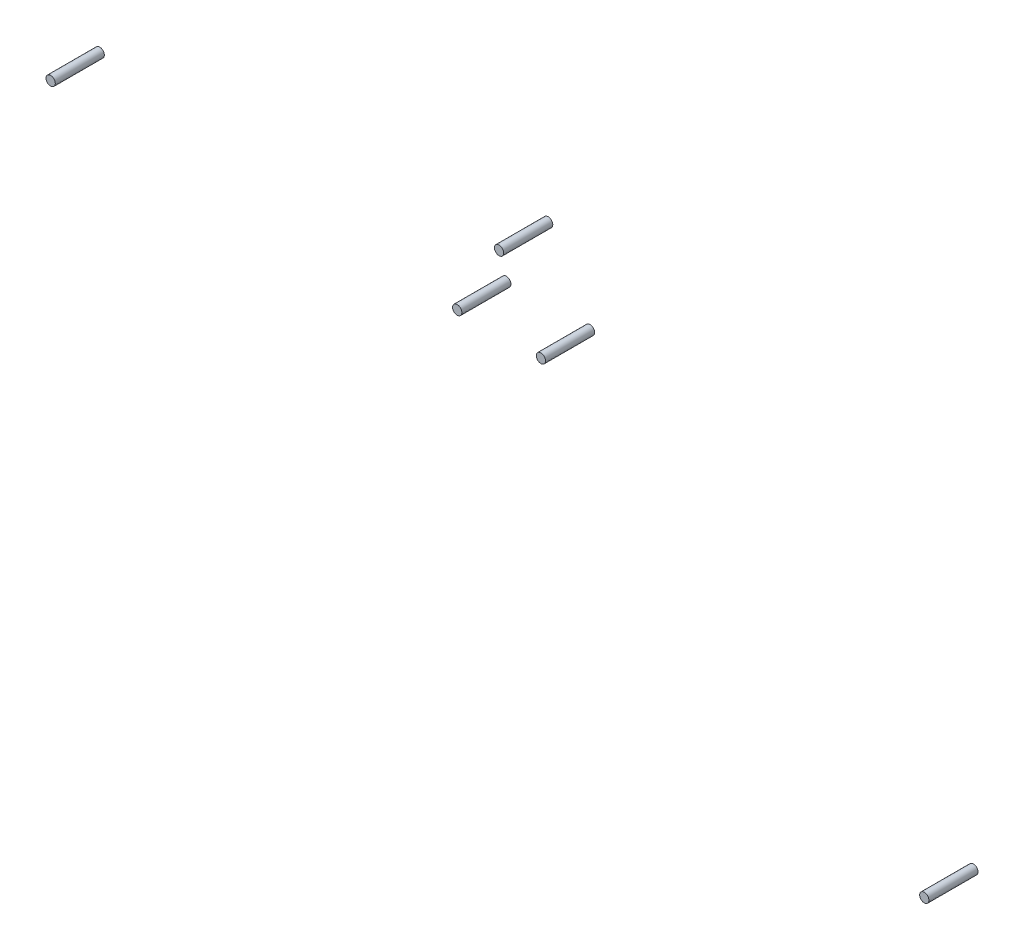
ISO-10303-21;
HEADER;
FILE_DESCRIPTION(('STEP AP214'),'2;1');
FILE_NAME('part.step','',(''),(''),'','','');
FILE_SCHEMA(('AUTOMOTIVE_DESIGN { 1 0 10303 214 1 1 1 1 }'));
ENDSEC;
DATA;
#1=APPLICATION_CONTEXT('core data for automotive mechanical design processes');
#2=APPLICATION_PROTOCOL_DEFINITION('international standard','automotive_design',2000,#1);
#3=PRODUCT_CONTEXT('',#1,'mechanical');
#4=PRODUCT('Part','Part','',(#3));
#5=PRODUCT_RELATED_PRODUCT_CATEGORY('part','',(#4));
#6=PRODUCT_DEFINITION_FORMATION('','',#4);
#7=PRODUCT_DEFINITION_CONTEXT('part definition',#1,'design');
#8=PRODUCT_DEFINITION('design','',#6,#7);
#9=PRODUCT_DEFINITION_SHAPE('','',#8);
#10=(LENGTH_UNIT() NAMED_UNIT(*) SI_UNIT(.MILLI.,.METRE.));
#11=(NAMED_UNIT(*) PLANE_ANGLE_UNIT() SI_UNIT($,.RADIAN.));
#12=(NAMED_UNIT(*) SI_UNIT($,.STERADIAN.) SOLID_ANGLE_UNIT());
#13=UNCERTAINTY_MEASURE_WITH_UNIT(LENGTH_MEASURE(1.E-05),#10,'distance_accuracy_value','');
#14=(GEOMETRIC_REPRESENTATION_CONTEXT(3) GLOBAL_UNCERTAINTY_ASSIGNED_CONTEXT((#13)) GLOBAL_UNIT_ASSIGNED_CONTEXT((#10,
#11,#12)) REPRESENTATION_CONTEXT('',''));
#15=CARTESIAN_POINT('',(0.,0.,0.));
#16=DIRECTION('',(0.,0.,1.));
#17=DIRECTION('',(1.,0.,0.));
#18=AXIS2_PLACEMENT_3D('',#15,#16,#17);
#19=CARTESIAN_POINT('',(-66.4999999999998,49.7499999999999,6.35));
#20=DIRECTION('',(0.,0.,-1.));
#21=DIRECTION('',(-1.,0.,0.));
#22=AXIS2_PLACEMENT_3D('',#19,#20,#21);
#23=CYLINDRICAL_SURFACE('',#22,0.600000000000008);
#24=CARTESIAN_POINT('',(-66.4999999999998,49.7499999999999,6.35));
#25=DIRECTION('',(0.,0.,1.));
#26=DIRECTION('',(1.,0.,0.));
#27=AXIS2_PLACEMENT_3D('',#24,#25,#26);
#28=CIRCLE('',#27,0.600000000000008);
#29=CARTESIAN_POINT('',(-65.8999999999998,49.7499999999999,6.35));
#30=VERTEX_POINT('',#29);
#31=EDGE_CURVE('E11',#30,#30,#28,.T.);
#32=ORIENTED_EDGE('',*,*,#31,.F.);
#33=EDGE_LOOP('',(#32));
#34=FACE_BOUND('',#33,.T.);
#35=CARTESIAN_POINT('',(-66.4999999999998,49.7499999999999,0.));
#36=DIRECTION('',(0.,0.,1.));
#37=DIRECTION('',(1.,0.,0.));
#38=AXIS2_PLACEMENT_3D('',#35,#36,#37);
#39=CIRCLE('',#38,0.600000000000008);
#40=CARTESIAN_POINT('',(-65.8999999999998,49.7499999999999,0.));
#41=VERTEX_POINT('',#40);
#42=EDGE_CURVE('E43',#41,#41,#39,.T.);
#43=ORIENTED_EDGE('',*,*,#42,.T.);
#44=EDGE_LOOP('',(#43));
#45=FACE_BOUND('',#44,.T.);
#46=ADVANCED_FACE('F40',(#34,#45),#23,.T.);
#47=CARTESIAN_POINT('',(-66.4999999999998,49.7499999999999,6.35));
#48=DIRECTION('',(0.,0.,1.));
#49=DIRECTION('',(1.,0.,0.));
#50=AXIS2_PLACEMENT_3D('',#47,#48,#49);
#51=PLANE('',#50);
#52=ORIENTED_EDGE('',*,*,#31,.T.);
#53=EDGE_LOOP('',(#52));
#54=FACE_BOUND('',#53,.T.);
#55=ADVANCED_FACE('F55',(#54),#51,.T.);
#56=CARTESIAN_POINT('',(-66.4999999999998,49.7499999999999,0.));
#57=DIRECTION('',(0.,0.,1.));
#58=DIRECTION('',(1.,0.,0.));
#59=AXIS2_PLACEMENT_3D('',#56,#57,#58);
#60=PLANE('',#59);
#61=ORIENTED_EDGE('',*,*,#42,.F.);
#62=EDGE_LOOP('',(#61));
#63=FACE_BOUND('',#62,.T.);
#64=ADVANCED_FACE('F53',(#63),#60,.F.);
#65=CLOSED_SHELL('',(#46,#55,#64));
#66=MANIFOLD_SOLID_BREP('B2',#65);
#67=CARTESIAN_POINT('',(46.5000000000002,14.7499999999999,6.35));
#68=DIRECTION('',(0.,0.,-1.));
#69=DIRECTION('',(-1.,0.,0.));
#70=AXIS2_PLACEMENT_3D('',#67,#68,#69);
#71=CYLINDRICAL_SURFACE('',#70,0.599999999999992);
#72=CARTESIAN_POINT('',(46.5000000000002,14.7499999999999,6.35));
#73=DIRECTION('',(0.,0.,1.));
#74=DIRECTION('',(1.,0.,0.));
#75=AXIS2_PLACEMENT_3D('',#72,#73,#74);
#76=CIRCLE('',#75,0.599999999999992);
#77=CARTESIAN_POINT('',(47.1000000000002,14.7499999999999,6.35));
#78=VERTEX_POINT('',#77);
#79=EDGE_CURVE('E39',#78,#78,#76,.T.);
#80=ORIENTED_EDGE('',*,*,#79,.F.);
#81=EDGE_LOOP('',(#80));
#82=FACE_BOUND('',#81,.T.);
#83=CARTESIAN_POINT('',(46.5000000000002,14.7499999999999,0.));
#84=DIRECTION('',(0.,0.,1.));
#85=DIRECTION('',(1.,0.,0.));
#86=AXIS2_PLACEMENT_3D('',#83,#84,#85);
#87=CIRCLE('',#86,0.599999999999992);
#88=CARTESIAN_POINT('',(47.1000000000002,14.7499999999999,0.));
#89=VERTEX_POINT('',#88);
#90=EDGE_CURVE('E92',#89,#89,#87,.T.);
#91=ORIENTED_EDGE('',*,*,#90,.T.);
#92=EDGE_LOOP('',(#91));
#93=FACE_BOUND('',#92,.T.);
#94=ADVANCED_FACE('F89',(#82,#93),#71,.T.);
#95=CARTESIAN_POINT('',(46.5000000000002,14.7499999999999,6.35));
#96=DIRECTION('',(0.,0.,1.));
#97=DIRECTION('',(1.,0.,0.));
#98=AXIS2_PLACEMENT_3D('',#95,#96,#97);
#99=PLANE('',#98);
#100=ORIENTED_EDGE('',*,*,#79,.T.);
#101=EDGE_LOOP('',(#100));
#102=FACE_BOUND('',#101,.T.);
#103=ADVANCED_FACE('F104',(#102),#99,.T.);
#104=CARTESIAN_POINT('',(46.5000000000002,14.7499999999999,0.));
#105=DIRECTION('',(0.,0.,1.));
#106=DIRECTION('',(1.,0.,0.));
#107=AXIS2_PLACEMENT_3D('',#104,#105,#106);
#108=PLANE('',#107);
#109=ORIENTED_EDGE('',*,*,#90,.F.);
#110=EDGE_LOOP('',(#109));
#111=FACE_BOUND('',#110,.T.);
#112=ADVANCED_FACE('F102',(#111),#108,.F.);
#113=CLOSED_SHELL('',(#94,#103,#112));
#114=MANIFOLD_SOLID_BREP('B6',#113);
#115=CARTESIAN_POINT('',(-13.9126587736528,50.3749999999999,6.35));
#116=DIRECTION('',(0.,0.,-1.));
#117=DIRECTION('',(-1.,0.,0.));
#118=AXIS2_PLACEMENT_3D('',#115,#116,#117);
#119=CYLINDRICAL_SURFACE('',#118,0.599999999999997);
#120=CARTESIAN_POINT('',(-13.9126587736528,50.3749999999999,6.35));
#121=DIRECTION('',(0.,0.,1.));
#122=DIRECTION('',(1.,0.,0.));
#123=AXIS2_PLACEMENT_3D('',#120,#121,#122);
#124=CIRCLE('',#123,0.599999999999997);
#125=CARTESIAN_POINT('',(-13.3126587736528,50.3749999999999,6.35));
#126=VERTEX_POINT('',#125);
#127=EDGE_CURVE('E88',#126,#126,#124,.T.);
#128=ORIENTED_EDGE('',*,*,#127,.F.);
#129=EDGE_LOOP('',(#128));
#130=FACE_BOUND('',#129,.T.);
#131=CARTESIAN_POINT('',(-13.9126587736528,50.3749999999999,0.));
#132=DIRECTION('',(0.,0.,1.));
#133=DIRECTION('',(1.,0.,0.));
#134=AXIS2_PLACEMENT_3D('',#131,#132,#133);
#135=CIRCLE('',#134,0.599999999999997);
#136=CARTESIAN_POINT('',(-13.3126587736528,50.3749999999999,0.));
#137=VERTEX_POINT('',#136);
#138=EDGE_CURVE('E141',#137,#137,#135,.T.);
#139=ORIENTED_EDGE('',*,*,#138,.T.);
#140=EDGE_LOOP('',(#139));
#141=FACE_BOUND('',#140,.T.);
#142=ADVANCED_FACE('F138',(#130,#141),#119,.T.);
#143=CARTESIAN_POINT('',(-13.9126587736528,50.3749999999999,6.35));
#144=DIRECTION('',(0.,0.,1.));
#145=DIRECTION('',(1.,0.,0.));
#146=AXIS2_PLACEMENT_3D('',#143,#144,#145);
#147=PLANE('',#146);
#148=ORIENTED_EDGE('',*,*,#127,.T.);
#149=EDGE_LOOP('',(#148));
#150=FACE_BOUND('',#149,.T.);
#151=ADVANCED_FACE('F153',(#150),#147,.T.);
#152=CARTESIAN_POINT('',(-13.9126587736528,50.3749999999999,0.));
#153=DIRECTION('',(0.,0.,1.));
#154=DIRECTION('',(1.,0.,0.));
#155=AXIS2_PLACEMENT_3D('',#152,#153,#154);
#156=PLANE('',#155);
#157=ORIENTED_EDGE('',*,*,#138,.F.);
#158=EDGE_LOOP('',(#157));
#159=FACE_BOUND('',#158,.T.);
#160=ADVANCED_FACE('F151',(#159),#156,.F.);
#161=CLOSED_SHELL('',(#142,#151,#160));
#162=MANIFOLD_SOLID_BREP('B34',#161);
#163=CARTESIAN_POINT('',(-8.49999999999976,59.7499999999999,6.35));
#164=DIRECTION('',(0.,0.,-1.));
#165=DIRECTION('',(-1.,0.,0.));
#166=AXIS2_PLACEMENT_3D('',#163,#164,#165);
#167=CYLINDRICAL_SURFACE('',#166,0.599999999999997);
#168=CARTESIAN_POINT('',(-8.49999999999976,59.7499999999999,6.35));
#169=DIRECTION('',(0.,0.,1.));
#170=DIRECTION('',(1.,0.,0.));
#171=AXIS2_PLACEMENT_3D('',#168,#169,#170);
#172=CIRCLE('',#171,0.599999999999997);
#173=CARTESIAN_POINT('',(-7.89999999999976,59.7499999999999,6.35));
#174=VERTEX_POINT('',#173);
#175=EDGE_CURVE('E137',#174,#174,#172,.T.);
#176=ORIENTED_EDGE('',*,*,#175,.F.);
#177=EDGE_LOOP('',(#176));
#178=FACE_BOUND('',#177,.T.);
#179=CARTESIAN_POINT('',(-8.49999999999976,59.7499999999999,0.));
#180=DIRECTION('',(0.,0.,1.));
#181=DIRECTION('',(1.,0.,0.));
#182=AXIS2_PLACEMENT_3D('',#179,#180,#181);
#183=CIRCLE('',#182,0.599999999999997);
#184=CARTESIAN_POINT('',(-7.89999999999976,59.7499999999999,0.));
#185=VERTEX_POINT('',#184);
#186=EDGE_CURVE('E189',#185,#185,#183,.T.);
#187=ORIENTED_EDGE('',*,*,#186,.T.);
#188=EDGE_LOOP('',(#187));
#189=FACE_BOUND('',#188,.T.);
#190=ADVANCED_FACE('F186',(#178,#189),#167,.T.);
#191=CARTESIAN_POINT('',(-8.49999999999976,59.7499999999999,6.35));
#192=DIRECTION('',(0.,0.,1.));
#193=DIRECTION('',(1.,0.,0.));
#194=AXIS2_PLACEMENT_3D('',#191,#192,#193);
#195=PLANE('',#194);
#196=ORIENTED_EDGE('',*,*,#175,.T.);
#197=EDGE_LOOP('',(#196));
#198=FACE_BOUND('',#197,.T.);
#199=ADVANCED_FACE('F201',(#198),#195,.T.);
#200=CARTESIAN_POINT('',(-8.49999999999976,59.7499999999999,0.));
#201=DIRECTION('',(0.,0.,1.));
#202=DIRECTION('',(1.,0.,0.));
#203=AXIS2_PLACEMENT_3D('',#200,#201,#202);
#204=PLANE('',#203);
#205=ORIENTED_EDGE('',*,*,#186,.F.);
#206=EDGE_LOOP('',(#205));
#207=FACE_BOUND('',#206,.T.);
#208=ADVANCED_FACE('F199',(#207),#204,.F.);
#209=CLOSED_SHELL('',(#190,#199,#208));
#210=MANIFOLD_SOLID_BREP('B83',#209);
#211=CARTESIAN_POINT('',(-3.08734122634675,50.3749999999999,6.35));
#212=DIRECTION('',(0.,0.,-1.));
#213=DIRECTION('',(-1.,0.,0.));
#214=AXIS2_PLACEMENT_3D('',#211,#212,#213);
#215=CYLINDRICAL_SURFACE('',#214,0.60000000000026);
#216=CARTESIAN_POINT('',(-3.08734122634675,50.3749999999999,6.35));
#217=DIRECTION('',(0.,0.,1.));
#218=DIRECTION('',(1.,0.,0.));
#219=AXIS2_PLACEMENT_3D('',#216,#217,#218);
#220=CIRCLE('',#219,0.60000000000026);
#221=CARTESIAN_POINT('',(-2.48734122634649,50.3749999999999,6.35));
#222=VERTEX_POINT('',#221);
#223=EDGE_CURVE('E185',#222,#222,#220,.T.);
#224=ORIENTED_EDGE('',*,*,#223,.F.);
#225=EDGE_LOOP('',(#224));
#226=FACE_BOUND('',#225,.T.);
#227=CARTESIAN_POINT('',(-3.08734122634675,50.3749999999999,0.));
#228=DIRECTION('',(0.,0.,1.));
#229=DIRECTION('',(1.,0.,0.));
#230=AXIS2_PLACEMENT_3D('',#227,#228,#229);
#231=CIRCLE('',#230,0.60000000000026);
#232=CARTESIAN_POINT('',(-2.48734122634649,50.3749999999999,0.));
#233=VERTEX_POINT('',#232);
#234=EDGE_CURVE('E230',#233,#233,#231,.T.);
#235=ORIENTED_EDGE('',*,*,#234,.T.);
#236=EDGE_LOOP('',(#235));
#237=FACE_BOUND('',#236,.T.);
#238=ADVANCED_FACE('F227',(#226,#237),#215,.T.);
#239=CARTESIAN_POINT('',(-3.08734122634675,50.3749999999999,6.35));
#240=DIRECTION('',(0.,0.,1.));
#241=DIRECTION('',(1.,0.,0.));
#242=AXIS2_PLACEMENT_3D('',#239,#240,#241);
#243=PLANE('',#242);
#244=ORIENTED_EDGE('',*,*,#223,.T.);
#245=EDGE_LOOP('',(#244));
#246=FACE_BOUND('',#245,.T.);
#247=ADVANCED_FACE('F242',(#246),#243,.T.);
#248=CARTESIAN_POINT('',(-3.08734122634675,50.3749999999999,0.));
#249=DIRECTION('',(0.,0.,1.));
#250=DIRECTION('',(1.,0.,0.));
#251=AXIS2_PLACEMENT_3D('',#248,#249,#250);
#252=PLANE('',#251);
#253=ORIENTED_EDGE('',*,*,#234,.F.);
#254=EDGE_LOOP('',(#253));
#255=FACE_BOUND('',#254,.T.);
#256=ADVANCED_FACE('F240',(#255),#252,.F.);
#257=CLOSED_SHELL('',(#238,#247,#256));
#258=MANIFOLD_SOLID_BREP('B132',#257);
#259=ADVANCED_BREP_SHAPE_REPRESENTATION('',(#18,#66,#114,#162,#210,#258),#14);
#260=SHAPE_DEFINITION_REPRESENTATION(#9,#259);
ENDSEC;
END-ISO-10303-21;
